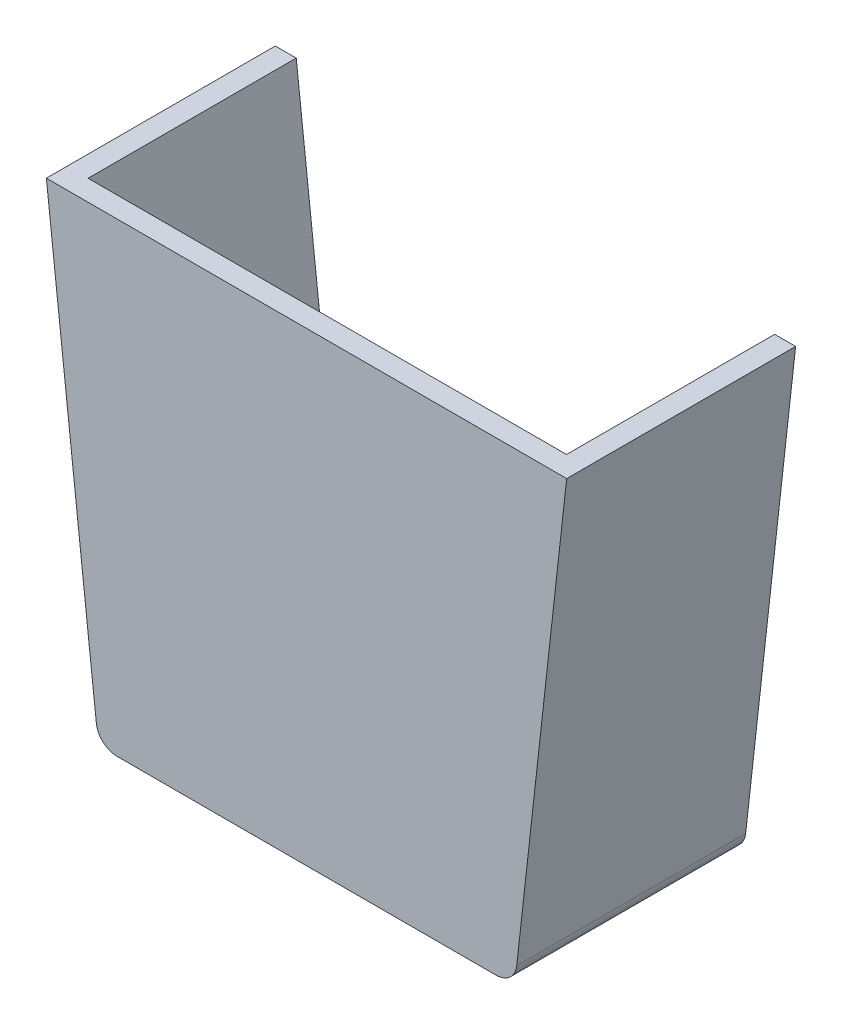
ISO-10303-21;
HEADER;
FILE_DESCRIPTION(('STEP AP214'),'2;1');
FILE_NAME('part.step','',(''),(''),'','','');
FILE_SCHEMA(('AUTOMOTIVE_DESIGN { 1 0 10303 214 1 1 1 1 }'));
ENDSEC;
DATA;
#1=APPLICATION_CONTEXT('core data for automotive mechanical design processes');
#2=APPLICATION_PROTOCOL_DEFINITION('international standard','automotive_design',2000,#1);
#3=PRODUCT_CONTEXT('',#1,'mechanical');
#4=PRODUCT('Part','Part','',(#3));
#5=PRODUCT_RELATED_PRODUCT_CATEGORY('part','',(#4));
#6=PRODUCT_DEFINITION_FORMATION('','',#4);
#7=PRODUCT_DEFINITION_CONTEXT('part definition',#1,'design');
#8=PRODUCT_DEFINITION('design','',#6,#7);
#9=PRODUCT_DEFINITION_SHAPE('','',#8);
#10=(LENGTH_UNIT() NAMED_UNIT(*) SI_UNIT(.MILLI.,.METRE.));
#11=(NAMED_UNIT(*) PLANE_ANGLE_UNIT() SI_UNIT($,.RADIAN.));
#12=(NAMED_UNIT(*) SI_UNIT($,.STERADIAN.) SOLID_ANGLE_UNIT());
#13=UNCERTAINTY_MEASURE_WITH_UNIT(LENGTH_MEASURE(1.E-05),#10,'distance_accuracy_value','');
#14=(GEOMETRIC_REPRESENTATION_CONTEXT(3) GLOBAL_UNCERTAINTY_ASSIGNED_CONTEXT((#13)) GLOBAL_UNIT_ASSIGNED_CONTEXT((#10,
#11,#12)) REPRESENTATION_CONTEXT('',''));
#15=CARTESIAN_POINT('',(0.,0.,0.));
#16=DIRECTION('',(0.,0.,1.));
#17=DIRECTION('',(1.,0.,0.));
#18=AXIS2_PLACEMENT_3D('',#15,#16,#17);
#19=CARTESIAN_POINT('',(0.,-56.7961260569893,-5.08));
#20=DIRECTION('',(0.,-1.,0.));
#21=DIRECTION('',(0.,0.,-1.));
#22=AXIS2_PLACEMENT_3D('',#19,#20,#21);
#23=PLANE('',#22);
#24=DIRECTION('',(1.,0.,0.));
#25=VECTOR('',#24,1.);
#26=CARTESIAN_POINT('',(0.,-56.7961260569893,0.));
#27=LINE('',#26,#25);
#28=CARTESIAN_POINT('',(-46.2563098697204,-56.7961260569893,0.));
#29=VERTEX_POINT('',#28);
#30=CARTESIAN_POINT('',(46.2563098697204,-56.7961260569893,0.));
#31=VERTEX_POINT('',#30);
#32=EDGE_CURVE('E134',#29,#31,#27,.T.);
#33=ORIENTED_EDGE('',*,*,#32,.F.);
#34=DIRECTION('',(0.,0.,1.));
#35=VECTOR('',#34,1.);
#36=CARTESIAN_POINT('',(-46.2563098697204,-56.7961260569893,-5.08));
#37=LINE('',#36,#35);
#38=CARTESIAN_POINT('',(-46.2563098697204,-56.7961260569893,-55.88));
#39=VERTEX_POINT('',#38);
#40=EDGE_CURVE('E11',#39,#29,#37,.T.);
#41=ORIENTED_EDGE('',*,*,#40,.F.);
#42=DIRECTION('',(-1.,0.,0.));
#43=VECTOR('',#42,1.);
#44=CARTESIAN_POINT('',(0.,-56.7961260569893,-55.88));
#45=LINE('',#44,#43);
#46=CARTESIAN_POINT('',(46.2563098697204,-56.7961260569893,-55.88));
#47=VERTEX_POINT('',#46);
#48=EDGE_CURVE('E132',#47,#39,#45,.T.);
#49=ORIENTED_EDGE('',*,*,#48,.F.);
#50=DIRECTION('',(0.,0.,1.));
#51=VECTOR('',#50,1.);
#52=CARTESIAN_POINT('',(46.2563098697204,-56.7961260569893,-5.08));
#53=LINE('',#52,#51);
#54=EDGE_CURVE('E44',#47,#31,#53,.T.);
#55=ORIENTED_EDGE('',*,*,#54,.T.);
#56=EDGE_LOOP('',(#33,#41,#49,#55));
#57=FACE_BOUND('',#56,.T.);
#58=ADVANCED_FACE('F41',(#57),#23,.T.);
#59=CARTESIAN_POINT('',(-46.2563098697204,-51.7161260569893,-5.08));
#60=DIRECTION('',(0.,0.,1.));
#61=DIRECTION('',(1.,0.,0.));
#62=AXIS2_PLACEMENT_3D('',#59,#60,#61);
#63=CYLINDRICAL_SURFACE('',#62,5.08);
#64=CARTESIAN_POINT('',(-46.2563098697204,-51.7161260569893,0.));
#65=DIRECTION('',(0.,0.,1.));
#66=DIRECTION('',(1.,0.,0.));
#67=AXIS2_PLACEMENT_3D('',#64,#65,#66);
#68=CIRCLE('',#67,5.08);
#69=CARTESIAN_POINT('',(-51.3048544589199,-52.2805705014337,0.));
#70=VERTEX_POINT('',#69);
#71=EDGE_CURVE('E228',#70,#29,#68,.T.);
#72=ORIENTED_EDGE('',*,*,#71,.F.);
#73=DIRECTION('',(0.,0.,1.));
#74=VECTOR('',#73,1.);
#75=CARTESIAN_POINT('',(-51.3048544589199,-52.2805705014337,-5.08));
#76=LINE('',#75,#74);
#77=CARTESIAN_POINT('',(-51.3048544589199,-52.2805705014337,-55.88));
#78=VERTEX_POINT('',#77);
#79=EDGE_CURVE('E50',#78,#70,#76,.T.);
#80=ORIENTED_EDGE('',*,*,#79,.F.);
#81=CARTESIAN_POINT('',(-46.2563098697204,-51.7161260569893,-55.88));
#82=DIRECTION('',(0.,0.,-1.));
#83=DIRECTION('',(-1.,0.,0.));
#84=AXIS2_PLACEMENT_3D('',#81,#82,#83);
#85=CIRCLE('',#84,5.08);
#86=EDGE_CURVE('E139',#39,#78,#85,.T.);
#87=ORIENTED_EDGE('',*,*,#86,.F.);
#88=ORIENTED_EDGE('',*,*,#40,.T.);
#89=EDGE_LOOP('',(#72,#80,#87,#88));
#90=FACE_BOUND('',#89,.T.);
#91=ADVANCED_FACE('F140',(#90),#63,.T.);
#92=CARTESIAN_POINT('',(-56.444444381337,-6.31068072944379,-5.08));
#93=DIRECTION('',(-0.993807989999906,-0.111111111111111,0.));
#94=DIRECTION('',(0.111111111111111,-0.993807989999906,0.));
#95=AXIS2_PLACEMENT_3D('',#92,#93,#94);
#96=PLANE('',#95);
#97=DIRECTION('',(0.111111111111111,-0.993807989999907,0.));
#98=VECTOR('',#97,1.);
#99=CARTESIAN_POINT('',(-56.444444381337,-6.31068072944379,0.));
#100=LINE('',#99,#98);
#101=CARTESIAN_POINT('',(-63.5,56.7961272,0.));
#102=VERTEX_POINT('',#101);
#103=EDGE_CURVE('E242',#102,#70,#100,.T.);
#104=ORIENTED_EDGE('',*,*,#103,.F.);
#105=DIRECTION('',(0.,0.,1.));
#106=VECTOR('',#105,1.);
#107=CARTESIAN_POINT('',(-63.5,56.7961272,-5.08));
#108=LINE('',#107,#106);
#109=CARTESIAN_POINT('',(-63.5,56.7961272,-55.88));
#110=VERTEX_POINT('',#109);
#111=EDGE_CURVE('E250',#110,#102,#108,.T.);
#112=ORIENTED_EDGE('',*,*,#111,.F.);
#113=DIRECTION('',(-0.111111111111111,0.993807989999907,0.));
#114=VECTOR('',#113,1.);
#115=CARTESIAN_POINT('',(-56.444444381337,-6.31068072944379,-55.88));
#116=LINE('',#115,#114);
#117=EDGE_CURVE('E145',#78,#110,#116,.T.);
#118=ORIENTED_EDGE('',*,*,#117,.F.);
#119=ORIENTED_EDGE('',*,*,#79,.T.);
#120=EDGE_LOOP('',(#104,#112,#118,#119));
#121=FACE_BOUND('',#120,.T.);
#122=ADVANCED_FACE('F268',(#121),#96,.T.);
#123=CARTESIAN_POINT('',(0.,56.7961272,-5.08));
#124=DIRECTION('',(0.,1.,0.));
#125=DIRECTION('',(-1.,0.,0.));
#126=AXIS2_PLACEMENT_3D('',#123,#124,#125);
#127=PLANE('',#126);
#128=DIRECTION('',(-1.,0.,0.));
#129=VECTOR('',#128,1.);
#130=CARTESIAN_POINT('',(0.,56.7961272,0.));
#131=LINE('',#130,#129);
#132=CARTESIAN_POINT('',(63.5,56.7961272,0.));
#133=VERTEX_POINT('',#132);
#134=EDGE_CURVE('E238',#133,#102,#131,.T.);
#135=ORIENTED_EDGE('',*,*,#134,.F.);
#136=DIRECTION('',(0.,0.,1.));
#137=VECTOR('',#136,1.);
#138=CARTESIAN_POINT('',(63.5,56.7961272,-5.08));
#139=LINE('',#138,#137);
#140=CARTESIAN_POINT('',(63.5,56.7961272,-55.88));
#141=VERTEX_POINT('',#140);
#142=EDGE_CURVE('E253',#141,#133,#139,.T.);
#143=ORIENTED_EDGE('',*,*,#142,.F.);
#144=DIRECTION('',(1.,0.,0.));
#145=VECTOR('',#144,1.);
#146=CARTESIAN_POINT('',(0.,56.7961272,-55.88));
#147=LINE('',#146,#145);
#148=CARTESIAN_POINT('',(58.3883477120718,56.7961272,-55.88));
#149=VERTEX_POINT('',#148);
#150=EDGE_CURVE('E180',#149,#141,#147,.T.);
#151=ORIENTED_EDGE('',*,*,#150,.F.);
#152=DIRECTION('',(0.,0.,1.));
#153=VECTOR('',#152,1.);
#154=CARTESIAN_POINT('',(58.3883477120718,56.7961272,-55.88));
#155=LINE('',#154,#153);
#156=CARTESIAN_POINT('',(58.3883477120718,56.7961272,-5.08));
#157=VERTEX_POINT('',#156);
#158=EDGE_CURVE('E189',#149,#157,#155,.T.);
#159=ORIENTED_EDGE('',*,*,#158,.T.);
#160=DIRECTION('',(-1.,0.,0.));
#161=VECTOR('',#160,1.);
#162=CARTESIAN_POINT('',(0.,56.7961272,-5.08));
#163=LINE('',#162,#161);
#164=CARTESIAN_POINT('',(-58.3883465976871,56.7961272,-5.08));
#165=VERTEX_POINT('',#164);
#166=EDGE_CURVE('E224',#157,#165,#163,.T.);
#167=ORIENTED_EDGE('',*,*,#166,.T.);
#168=DIRECTION('',(0.,0.,1.));
#169=VECTOR('',#168,1.);
#170=CARTESIAN_POINT('',(-58.3883465976871,56.7961272,-55.88));
#171=LINE('',#170,#169);
#172=CARTESIAN_POINT('',(-58.3883465976871,56.7961272,-55.88));
#173=VERTEX_POINT('',#172);
#174=EDGE_CURVE('E220',#173,#165,#171,.T.);
#175=ORIENTED_EDGE('',*,*,#174,.F.);
#176=DIRECTION('',(1.,0.,0.));
#177=VECTOR('',#176,1.);
#178=CARTESIAN_POINT('',(0.,56.7961272,-55.88));
#179=LINE('',#178,#177);
#180=EDGE_CURVE('E159',#110,#173,#179,.T.);
#181=ORIENTED_EDGE('',*,*,#180,.F.);
#182=ORIENTED_EDGE('',*,*,#111,.T.);
#183=EDGE_LOOP('',(#135,#143,#151,#159,#167,#175,#181,#182));
#184=FACE_BOUND('',#183,.T.);
#185=ADVANCED_FACE('F272',(#184),#127,.T.);
#186=CARTESIAN_POINT('',(56.444444381337,-6.31068072944378,-5.08));
#187=DIRECTION('',(-0.993807989999906,0.111111111111111,0.));
#188=DIRECTION('',(-0.111111111111111,-0.993807989999907,0.));
#189=AXIS2_PLACEMENT_3D('',#186,#187,#188);
#190=PLANE('',#189);
#191=DIRECTION('',(-0.111111111111111,-0.993807989999907,0.));
#192=VECTOR('',#191,1.);
#193=CARTESIAN_POINT('',(56.444444381337,-6.31068072944378,0.));
#194=LINE('',#193,#192);
#195=CARTESIAN_POINT('',(51.30485445892,-52.2805705014337,0.));
#196=VERTEX_POINT('',#195);
#197=EDGE_CURVE('E235',#133,#196,#194,.T.);
#198=ORIENTED_EDGE('',*,*,#197,.T.);
#199=DIRECTION('',(0.,0.,1.));
#200=VECTOR('',#199,1.);
#201=CARTESIAN_POINT('',(51.30485445892,-52.2805705014337,-5.08));
#202=LINE('',#201,#200);
#203=CARTESIAN_POINT('',(51.30485445892,-52.2805705014337,-55.88));
#204=VERTEX_POINT('',#203);
#205=EDGE_CURVE('E255',#204,#196,#202,.T.);
#206=ORIENTED_EDGE('',*,*,#205,.F.);
#207=DIRECTION('',(-0.111111111111111,-0.993807989999907,0.));
#208=VECTOR('',#207,1.);
#209=CARTESIAN_POINT('',(56.444444381337,-6.31068072944378,-55.88));
#210=LINE('',#209,#208);
#211=EDGE_CURVE('E184',#141,#204,#210,.T.);
#212=ORIENTED_EDGE('',*,*,#211,.F.);
#213=ORIENTED_EDGE('',*,*,#142,.T.);
#214=EDGE_LOOP('',(#198,#206,#212,#213));
#215=FACE_BOUND('',#214,.T.);
#216=ADVANCED_FACE('F294',(#215),#190,.F.);
#217=CARTESIAN_POINT('',(46.2563098697204,-51.7161260569893,-5.08));
#218=DIRECTION('',(0.,0.,1.));
#219=DIRECTION('',(1.,0.,0.));
#220=AXIS2_PLACEMENT_3D('',#217,#218,#219);
#221=CYLINDRICAL_SURFACE('',#220,5.08);
#222=CARTESIAN_POINT('',(46.2563098697204,-51.7161260569893,0.));
#223=DIRECTION('',(0.,0.,1.));
#224=DIRECTION('',(1.,0.,0.));
#225=AXIS2_PLACEMENT_3D('',#222,#223,#224);
#226=CIRCLE('',#225,5.08);
#227=EDGE_CURVE('E231',#196,#31,#226,.F.);
#228=ORIENTED_EDGE('',*,*,#227,.T.);
#229=ORIENTED_EDGE('',*,*,#54,.F.);
#230=CARTESIAN_POINT('',(46.2563098697204,-51.7161260569893,-55.88));
#231=DIRECTION('',(0.,0.,-1.));
#232=DIRECTION('',(-1.,0.,0.));
#233=AXIS2_PLACEMENT_3D('',#230,#231,#232);
#234=CIRCLE('',#233,5.08);
#235=EDGE_CURVE('E151',#204,#47,#234,.T.);
#236=ORIENTED_EDGE('',*,*,#235,.F.);
#237=ORIENTED_EDGE('',*,*,#205,.T.);
#238=EDGE_LOOP('',(#228,#229,#236,#237));
#239=FACE_BOUND('',#238,.T.);
#240=ADVANCED_FACE('F261',(#239),#221,.T.);
#241=CARTESIAN_POINT('',(0.,0.,-5.08));
#242=DIRECTION('',(0.,0.,1.));
#243=DIRECTION('',(1.,0.,0.));
#244=AXIS2_PLACEMENT_3D('',#241,#242,#243);
#245=PLANE('',#244);
#246=ORIENTED_EDGE('',*,*,#166,.F.);
#247=DIRECTION('',(-0.11111109265511,-0.99380799206335,0.));
#248=VECTOR('',#247,1.);
#249=CARTESIAN_POINT('',(51.3959001799654,-5.74623536195601,-5.08));
#250=LINE('',#249,#248);
#251=CARTESIAN_POINT('',(46.7611653685987,-47.2005707173621,-5.08));
#252=VERTEX_POINT('',#251);
#253=EDGE_CURVE('E58',#157,#252,#250,.T.);
#254=ORIENTED_EDGE('',*,*,#253,.T.);
#255=CARTESIAN_POINT('',(41.7126207689168,-46.6361263666741,-5.08));
#256=DIRECTION('',(0.,0.,-1.));
#257=DIRECTION('',(-1.,0.,0.));
#258=AXIS2_PLACEMENT_3D('',#255,#256,#257);
#259=CIRCLE('',#258,5.08);
#260=CARTESIAN_POINT('',(41.7126207689168,-51.7161263666741,-5.08));
#261=VERTEX_POINT('',#260);
#262=EDGE_CURVE('E63',#252,#261,#259,.T.);
#263=ORIENTED_EDGE('',*,*,#262,.T.);
#264=DIRECTION('',(-1.,0.,0.));
#265=VECTOR('',#264,1.);
#266=CARTESIAN_POINT('',(0.,-51.7161263666741,-5.08));
#267=LINE('',#266,#265);
#268=CARTESIAN_POINT('',(-41.7126196545321,-51.7161263666741,-5.08));
#269=VERTEX_POINT('',#268);
#270=EDGE_CURVE('E198',#261,#269,#267,.T.);
#271=ORIENTED_EDGE('',*,*,#270,.T.);
#272=CARTESIAN_POINT('',(-41.7126196545321,-46.6361263666741,-5.08));
#273=DIRECTION('',(0.,0.,-1.));
#274=DIRECTION('',(-1.,0.,0.));
#275=AXIS2_PLACEMENT_3D('',#272,#273,#274);
#276=CIRCLE('',#275,5.08);
#277=CARTESIAN_POINT('',(-46.761164254214,-47.2005707173621,-5.08));
#278=VERTEX_POINT('',#277);
#279=EDGE_CURVE('E194',#278,#269,#276,.F.);
#280=ORIENTED_EDGE('',*,*,#279,.F.);
#281=DIRECTION('',(0.11111109265511,-0.99380799206335,0.));
#282=VECTOR('',#281,1.);
#283=CARTESIAN_POINT('',(-51.3958990793386,-5.74623523890221,-5.08));
#284=LINE('',#283,#282);
#285=EDGE_CURVE('E190',#165,#278,#284,.T.);
#286=ORIENTED_EDGE('',*,*,#285,.F.);
#287=EDGE_LOOP('',(#246,#254,#263,#271,#280,#286));
#288=FACE_BOUND('',#287,.T.);
#289=ADVANCED_FACE('F301',(#288),#245,.F.);
#290=CARTESIAN_POINT('',(0.,0.,0.));
#291=DIRECTION('',(0.,0.,1.));
#292=DIRECTION('',(1.,0.,0.));
#293=AXIS2_PLACEMENT_3D('',#290,#291,#292);
#294=PLANE('',#293);
#295=ORIENTED_EDGE('',*,*,#32,.T.);
#296=ORIENTED_EDGE('',*,*,#227,.F.);
#297=ORIENTED_EDGE('',*,*,#197,.F.);
#298=ORIENTED_EDGE('',*,*,#134,.T.);
#299=ORIENTED_EDGE('',*,*,#103,.T.);
#300=ORIENTED_EDGE('',*,*,#71,.T.);
#301=EDGE_LOOP('',(#295,#296,#297,#298,#299,#300));
#302=FACE_BOUND('',#301,.T.);
#303=ADVANCED_FACE('F264',(#302),#294,.T.);
#304=CARTESIAN_POINT('',(-51.3958990793386,-5.74623523890221,-55.88));
#305=DIRECTION('',(-0.99380799206335,-0.11111109265511,0.));
#306=DIRECTION('',(0.11111109265511,-0.99380799206335,0.));
#307=AXIS2_PLACEMENT_3D('',#304,#305,#306);
#308=PLANE('',#307);
#309=ORIENTED_EDGE('',*,*,#285,.T.);
#310=DIRECTION('',(0.,0.,1.));
#311=VECTOR('',#310,1.);
#312=CARTESIAN_POINT('',(-46.761164254214,-47.2005707173621,-55.88));
#313=LINE('',#312,#311);
#314=CARTESIAN_POINT('',(-46.761164254214,-47.2005707173621,-55.88));
#315=VERTEX_POINT('',#314);
#316=EDGE_CURVE('E216',#315,#278,#313,.T.);
#317=ORIENTED_EDGE('',*,*,#316,.F.);
#318=DIRECTION('',(0.11111109265511,-0.99380799206335,0.));
#319=VECTOR('',#318,1.);
#320=CARTESIAN_POINT('',(-51.3958990793386,-5.74623523890221,-55.88));
#321=LINE('',#320,#319);
#322=EDGE_CURVE('E162',#173,#315,#321,.T.);
#323=ORIENTED_EDGE('',*,*,#322,.F.);
#324=ORIENTED_EDGE('',*,*,#174,.T.);
#325=EDGE_LOOP('',(#309,#317,#323,#324));
#326=FACE_BOUND('',#325,.T.);
#327=ADVANCED_FACE('F276',(#326),#308,.F.);
#328=CARTESIAN_POINT('',(-41.7126196545321,-46.6361263666741,-55.88));
#329=DIRECTION('',(0.,0.,1.));
#330=DIRECTION('',(1.,0.,0.));
#331=AXIS2_PLACEMENT_3D('',#328,#329,#330);
#332=CYLINDRICAL_SURFACE('',#331,5.08);
#333=ORIENTED_EDGE('',*,*,#279,.T.);
#334=DIRECTION('',(0.,0.,1.));
#335=VECTOR('',#334,1.);
#336=CARTESIAN_POINT('',(-41.7126196545321,-51.7161263666741,-55.88));
#337=LINE('',#336,#335);
#338=CARTESIAN_POINT('',(-41.7126196545321,-51.7161263666741,-55.88));
#339=VERTEX_POINT('',#338);
#340=EDGE_CURVE('E212',#339,#269,#337,.T.);
#341=ORIENTED_EDGE('',*,*,#340,.F.);
#342=CARTESIAN_POINT('',(-41.7126196545321,-46.6361263666741,-55.88));
#343=DIRECTION('',(0.,0.,-1.));
#344=DIRECTION('',(-1.,0.,0.));
#345=AXIS2_PLACEMENT_3D('',#342,#343,#344);
#346=CIRCLE('',#345,5.08);
#347=EDGE_CURVE('E165',#315,#339,#346,.F.);
#348=ORIENTED_EDGE('',*,*,#347,.F.);
#349=ORIENTED_EDGE('',*,*,#316,.T.);
#350=EDGE_LOOP('',(#333,#341,#348,#349));
#351=FACE_BOUND('',#350,.T.);
#352=ADVANCED_FACE('F282',(#351),#332,.F.);
#353=CARTESIAN_POINT('',(0.,-51.7161263666741,-55.88));
#354=DIRECTION('',(0.,1.,0.));
#355=DIRECTION('',(0.,0.,1.));
#356=AXIS2_PLACEMENT_3D('',#353,#354,#355);
#357=PLANE('',#356);
#358=ORIENTED_EDGE('',*,*,#270,.F.);
#359=DIRECTION('',(0.,0.,1.));
#360=VECTOR('',#359,1.);
#361=CARTESIAN_POINT('',(41.7126207689168,-51.7161263666741,-55.88));
#362=LINE('',#361,#360);
#363=CARTESIAN_POINT('',(41.7126207689168,-51.7161263666741,-55.88));
#364=VERTEX_POINT('',#363);
#365=EDGE_CURVE('E209',#364,#261,#362,.T.);
#366=ORIENTED_EDGE('',*,*,#365,.F.);
#367=DIRECTION('',(-1.,0.,0.));
#368=VECTOR('',#367,1.);
#369=CARTESIAN_POINT('',(0.,-51.7161263666741,-55.88));
#370=LINE('',#369,#368);
#371=EDGE_CURVE('E168',#364,#339,#370,.T.);
#372=ORIENTED_EDGE('',*,*,#371,.T.);
#373=ORIENTED_EDGE('',*,*,#340,.T.);
#374=EDGE_LOOP('',(#358,#366,#372,#373));
#375=FACE_BOUND('',#374,.T.);
#376=ADVANCED_FACE('F285',(#375),#357,.T.);
#377=CARTESIAN_POINT('',(41.7126207689168,-46.6361263666741,-55.88));
#378=DIRECTION('',(0.,0.,1.));
#379=DIRECTION('',(1.,0.,0.));
#380=AXIS2_PLACEMENT_3D('',#377,#378,#379);
#381=CYLINDRICAL_SURFACE('',#380,5.08);
#382=ORIENTED_EDGE('',*,*,#262,.F.);
#383=DIRECTION('',(0.,0.,1.));
#384=VECTOR('',#383,1.);
#385=CARTESIAN_POINT('',(46.7611653685987,-47.2005707173621,-55.88));
#386=LINE('',#385,#384);
#387=CARTESIAN_POINT('',(46.7611653685987,-47.2005707173621,-55.88));
#388=VERTEX_POINT('',#387);
#389=EDGE_CURVE('E206',#388,#252,#386,.T.);
#390=ORIENTED_EDGE('',*,*,#389,.F.);
#391=CARTESIAN_POINT('',(41.7126207689168,-46.6361263666741,-55.88));
#392=DIRECTION('',(0.,0.,-1.));
#393=DIRECTION('',(-1.,0.,0.));
#394=AXIS2_PLACEMENT_3D('',#391,#392,#393);
#395=CIRCLE('',#394,5.08);
#396=EDGE_CURVE('E172',#388,#364,#395,.T.);
#397=ORIENTED_EDGE('',*,*,#396,.T.);
#398=ORIENTED_EDGE('',*,*,#365,.T.);
#399=EDGE_LOOP('',(#382,#390,#397,#398));
#400=FACE_BOUND('',#399,.T.);
#401=ADVANCED_FACE('F287',(#400),#381,.F.);
#402=CARTESIAN_POINT('',(51.3959001799654,-5.74623536195601,-55.88));
#403=DIRECTION('',(-0.99380799206335,0.11111109265511,0.));
#404=DIRECTION('',(-0.11111109265511,-0.99380799206335,0.));
#405=AXIS2_PLACEMENT_3D('',#402,#403,#404);
#406=PLANE('',#405);
#407=ORIENTED_EDGE('',*,*,#253,.F.);
#408=ORIENTED_EDGE('',*,*,#158,.F.);
#409=DIRECTION('',(-0.11111109265511,-0.99380799206335,0.));
#410=VECTOR('',#409,1.);
#411=CARTESIAN_POINT('',(51.3959001799654,-5.74623536195601,-55.88));
#412=LINE('',#411,#410);
#413=EDGE_CURVE('E176',#149,#388,#412,.T.);
#414=ORIENTED_EDGE('',*,*,#413,.T.);
#415=ORIENTED_EDGE('',*,*,#389,.T.);
#416=EDGE_LOOP('',(#407,#408,#414,#415));
#417=FACE_BOUND('',#416,.T.);
#418=ADVANCED_FACE('F290',(#417),#406,.T.);
#419=CARTESIAN_POINT('',(0.,0.,-55.88));
#420=DIRECTION('',(0.,0.,-1.));
#421=DIRECTION('',(-1.,0.,0.));
#422=AXIS2_PLACEMENT_3D('',#419,#420,#421);
#423=PLANE('',#422);
#424=ORIENTED_EDGE('',*,*,#48,.T.);
#425=ORIENTED_EDGE('',*,*,#86,.T.);
#426=ORIENTED_EDGE('',*,*,#117,.T.);
#427=ORIENTED_EDGE('',*,*,#180,.T.);
#428=ORIENTED_EDGE('',*,*,#322,.T.);
#429=ORIENTED_EDGE('',*,*,#347,.T.);
#430=ORIENTED_EDGE('',*,*,#371,.F.);
#431=ORIENTED_EDGE('',*,*,#396,.F.);
#432=ORIENTED_EDGE('',*,*,#413,.F.);
#433=ORIENTED_EDGE('',*,*,#150,.T.);
#434=ORIENTED_EDGE('',*,*,#211,.T.);
#435=ORIENTED_EDGE('',*,*,#235,.T.);
#436=EDGE_LOOP('',(#424,#425,#426,#427,#428,#429,#430,#431,#432,#433,#434,#435));
#437=FACE_BOUND('',#436,.T.);
#438=ADVANCED_FACE('F148',(#437),#423,.T.);
#439=CLOSED_SHELL('',(#58,#91,#122,#185,#216,#240,#289,#303,#327,#352,#376,#401,#418,#438));
#440=MANIFOLD_SOLID_BREP('B2',#439);
#441=ADVANCED_BREP_SHAPE_REPRESENTATION('',(#18,#440),#14);
#442=SHAPE_DEFINITION_REPRESENTATION(#9,#441);
ENDSEC;
END-ISO-10303-21;
